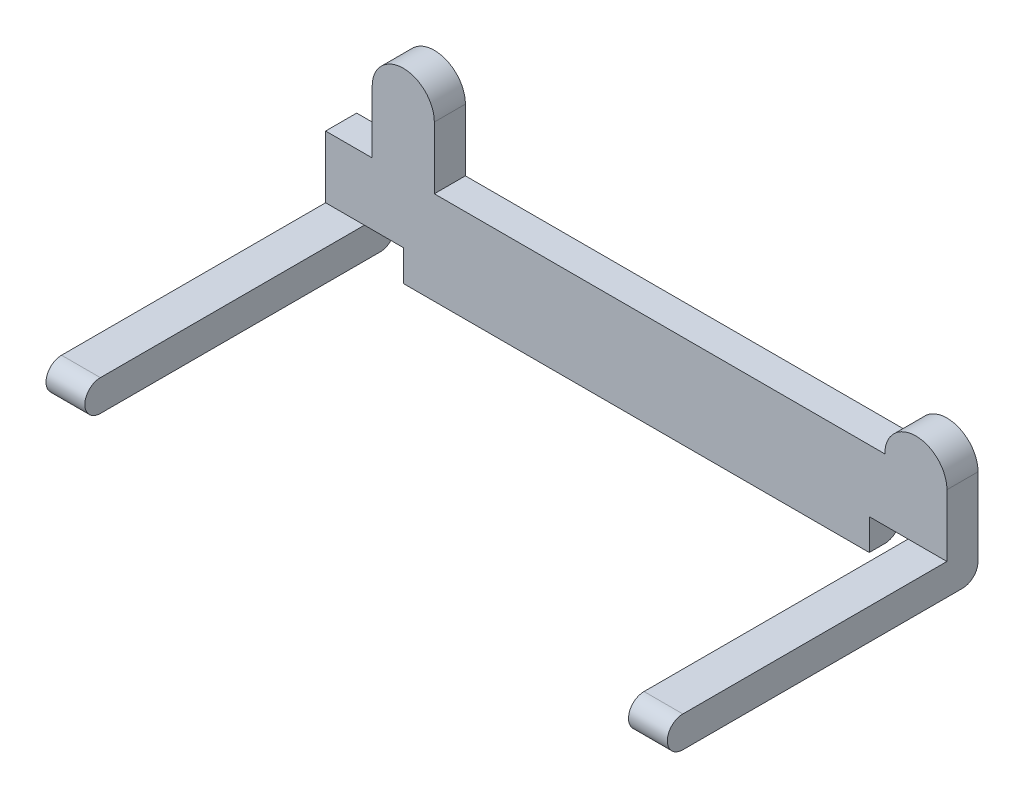
ISO-10303-21;
HEADER;
FILE_DESCRIPTION(('STEP AP214'),'2;1');
FILE_NAME('part.step','',(''),(''),'','','');
FILE_SCHEMA(('AUTOMOTIVE_DESIGN { 1 0 10303 214 1 1 1 1 }'));
ENDSEC;
DATA;
#1=APPLICATION_CONTEXT('core data for automotive mechanical design processes');
#2=APPLICATION_PROTOCOL_DEFINITION('international standard','automotive_design',2000,#1);
#3=PRODUCT_CONTEXT('',#1,'mechanical');
#4=PRODUCT('Part','Part','',(#3));
#5=PRODUCT_RELATED_PRODUCT_CATEGORY('part','',(#4));
#6=PRODUCT_DEFINITION_FORMATION('','',#4);
#7=PRODUCT_DEFINITION_CONTEXT('part definition',#1,'design');
#8=PRODUCT_DEFINITION('design','',#6,#7);
#9=PRODUCT_DEFINITION_SHAPE('','',#8);
#10=(LENGTH_UNIT() NAMED_UNIT(*) SI_UNIT(.MILLI.,.METRE.));
#11=(NAMED_UNIT(*) PLANE_ANGLE_UNIT() SI_UNIT($,.RADIAN.));
#12=(NAMED_UNIT(*) SI_UNIT($,.STERADIAN.) SOLID_ANGLE_UNIT());
#13=UNCERTAINTY_MEASURE_WITH_UNIT(LENGTH_MEASURE(1.E-05),#10,'distance_accuracy_value','');
#14=(GEOMETRIC_REPRESENTATION_CONTEXT(3) GLOBAL_UNCERTAINTY_ASSIGNED_CONTEXT((#13)) GLOBAL_UNIT_ASSIGNED_CONTEXT((#10,
#11,#12)) REPRESENTATION_CONTEXT('',''));
#15=CARTESIAN_POINT('',(0.,0.,0.));
#16=DIRECTION('',(0.,0.,1.));
#17=DIRECTION('',(1.,0.,0.));
#18=AXIS2_PLACEMENT_3D('',#15,#16,#17);
#19=CARTESIAN_POINT('',(80.,-2.,18.));
#20=DIRECTION('',(0.,1.,0.));
#21=DIRECTION('',(0.,0.,1.));
#22=AXIS2_PLACEMENT_3D('',#19,#20,#21);
#23=PLANE('',#22);
#24=DIRECTION('',(-1.,0.,0.));
#25=VECTOR('',#24,1.);
#26=CARTESIAN_POINT('',(80.,-1.99999999999999,-18.));
#27=LINE('',#26,#25);
#28=CARTESIAN_POINT('',(5.,-1.99999999999999,-18.));
#29=VERTEX_POINT('',#28);
#30=CARTESIAN_POINT('',(0.,-1.99999999999999,-18.));
#31=VERTEX_POINT('',#30);
#32=EDGE_CURVE('E316',#29,#31,#27,.T.);
#33=ORIENTED_EDGE('',*,*,#32,.F.);
#34=DIRECTION('',(0.,0.,1.));
#35=VECTOR('',#34,1.);
#36=CARTESIAN_POINT('',(4.99999999999999,-2.,18.));
#37=LINE('',#36,#35);
#38=CARTESIAN_POINT('',(4.99999999999999,-2.,18.));
#39=VERTEX_POINT('',#38);
#40=EDGE_CURVE('E219',#29,#39,#37,.T.);
#41=ORIENTED_EDGE('',*,*,#40,.T.);
#42=DIRECTION('',(-1.,0.,0.));
#43=VECTOR('',#42,1.);
#44=CARTESIAN_POINT('',(80.,-2.,18.));
#45=LINE('',#44,#43);
#46=CARTESIAN_POINT('',(0.,-2.,18.));
#47=VERTEX_POINT('',#46);
#48=EDGE_CURVE('E46',#39,#47,#45,.T.);
#49=ORIENTED_EDGE('',*,*,#48,.T.);
#50=DIRECTION('',(0.,0.,-1.));
#51=VECTOR('',#50,1.);
#52=CARTESIAN_POINT('',(0.,-2.,18.));
#53=LINE('',#52,#51);
#54=EDGE_CURVE('E300',#47,#31,#53,.T.);
#55=ORIENTED_EDGE('',*,*,#54,.T.);
#56=EDGE_LOOP('',(#33,#41,#49,#55));
#57=FACE_BOUND('',#56,.T.);
#58=ADVANCED_FACE('F38',(#57),#23,.F.);
#59=DIRECTION('',(0.,0.,-1.));
#60=VECTOR('',#59,1.);
#61=CARTESIAN_POINT('',(75.,-2.,18.));
#62=LINE('',#61,#60);
#63=CARTESIAN_POINT('',(75.,-2.,18.));
#64=VERTEX_POINT('',#63);
#65=CARTESIAN_POINT('',(75.,-2.,-18.));
#66=VERTEX_POINT('',#65);
#67=EDGE_CURVE('E226',#64,#66,#62,.T.);
#68=ORIENTED_EDGE('',*,*,#67,.T.);
#69=CARTESIAN_POINT('',(80.,-1.99999999999999,-18.));
#70=VERTEX_POINT('',#69);
#71=EDGE_CURVE('E318',#70,#66,#27,.T.);
#72=ORIENTED_EDGE('',*,*,#71,.F.);
#73=DIRECTION('',(0.,0.,-1.));
#74=VECTOR('',#73,1.);
#75=CARTESIAN_POINT('',(80.,-2.,18.));
#76=LINE('',#75,#74);
#77=CARTESIAN_POINT('',(80.,-2.,18.));
#78=VERTEX_POINT('',#77);
#79=EDGE_CURVE('E288',#78,#70,#76,.T.);
#80=ORIENTED_EDGE('',*,*,#79,.F.);
#81=EDGE_CURVE('E11',#78,#64,#45,.T.);
#82=ORIENTED_EDGE('',*,*,#81,.T.);
#83=EDGE_LOOP('',(#68,#72,#80,#82));
#84=FACE_BOUND('',#83,.T.);
#85=ADVANCED_FACE('F399',(#84),#23,.F.);
#86=CARTESIAN_POINT('',(80.,0.,-18.));
#87=DIRECTION('',(-1.,0.,0.));
#88=DIRECTION('',(0.,0.,1.));
#89=AXIS2_PLACEMENT_3D('',#86,#87,#88);
#90=CYLINDRICAL_SURFACE('',#89,2.);
#91=DIRECTION('',(-1.,0.,0.));
#92=VECTOR('',#91,1.);
#93=CARTESIAN_POINT('',(80.,0.,-20.));
#94=LINE('',#93,#92);
#95=CARTESIAN_POINT('',(4.99999999999999,0.,-20.));
#96=VERTEX_POINT('',#95);
#97=CARTESIAN_POINT('',(0.,0.,-20.));
#98=VERTEX_POINT('',#97);
#99=EDGE_CURVE('E313',#96,#98,#94,.T.);
#100=ORIENTED_EDGE('',*,*,#99,.F.);
#101=CARTESIAN_POINT('',(4.99999999999999,0.,-18.));
#102=DIRECTION('',(-1.,0.,0.));
#103=DIRECTION('',(0.,0.,1.));
#104=AXIS2_PLACEMENT_3D('',#101,#102,#103);
#105=CIRCLE('',#104,2.);
#106=EDGE_CURVE('E332',#96,#29,#105,.T.);
#107=ORIENTED_EDGE('',*,*,#106,.T.);
#108=ORIENTED_EDGE('',*,*,#32,.T.);
#109=CARTESIAN_POINT('',(0.,0.,-18.));
#110=DIRECTION('',(1.,0.,0.));
#111=DIRECTION('',(0.,0.,-1.));
#112=AXIS2_PLACEMENT_3D('',#109,#110,#111);
#113=CIRCLE('',#112,2.);
#114=EDGE_CURVE('E303',#31,#98,#113,.T.);
#115=ORIENTED_EDGE('',*,*,#114,.T.);
#116=EDGE_LOOP('',(#100,#107,#108,#115));
#117=FACE_BOUND('',#116,.T.);
#118=ADVANCED_FACE('F329',(#117),#90,.T.);
#119=ORIENTED_EDGE('',*,*,#71,.T.);
#120=CARTESIAN_POINT('',(75.,0.,-18.));
#121=DIRECTION('',(1.,0.,0.));
#122=DIRECTION('',(0.,0.,-1.));
#123=AXIS2_PLACEMENT_3D('',#120,#121,#122);
#124=CIRCLE('',#123,2.);
#125=CARTESIAN_POINT('',(75.,0.,-20.));
#126=VERTEX_POINT('',#125);
#127=EDGE_CURVE('E378',#66,#126,#124,.T.);
#128=ORIENTED_EDGE('',*,*,#127,.T.);
#129=CARTESIAN_POINT('',(80.,0.,-20.));
#130=VERTEX_POINT('',#129);
#131=EDGE_CURVE('E314',#130,#126,#94,.T.);
#132=ORIENTED_EDGE('',*,*,#131,.F.);
#133=CARTESIAN_POINT('',(80.,0.,-18.));
#134=DIRECTION('',(1.,0.,0.));
#135=DIRECTION('',(0.,0.,-1.));
#136=AXIS2_PLACEMENT_3D('',#133,#134,#135);
#137=CIRCLE('',#136,2.);
#138=EDGE_CURVE('E291',#70,#130,#137,.T.);
#139=ORIENTED_EDGE('',*,*,#138,.F.);
#140=EDGE_LOOP('',(#119,#128,#132,#139));
#141=FACE_BOUND('',#140,.T.);
#142=ADVANCED_FACE('F376',(#141),#90,.T.);
#143=CARTESIAN_POINT('',(80.,0.,18.));
#144=DIRECTION('',(-1.,0.,0.));
#145=DIRECTION('',(0.,0.,1.));
#146=AXIS2_PLACEMENT_3D('',#143,#144,#145);
#147=CYLINDRICAL_SURFACE('',#146,2.);
#148=ORIENTED_EDGE('',*,*,#48,.F.);
#149=CARTESIAN_POINT('',(4.99999999999999,0.,18.));
#150=DIRECTION('',(-1.,0.,0.));
#151=DIRECTION('',(0.,0.,1.));
#152=AXIS2_PLACEMENT_3D('',#149,#150,#151);
#153=CIRCLE('',#152,2.);
#154=CARTESIAN_POINT('',(5.,2.,18.));
#155=VERTEX_POINT('',#154);
#156=EDGE_CURVE('E223',#39,#155,#153,.T.);
#157=ORIENTED_EDGE('',*,*,#156,.T.);
#158=DIRECTION('',(-1.,0.,0.));
#159=VECTOR('',#158,1.);
#160=CARTESIAN_POINT('',(80.,2.,18.));
#161=LINE('',#160,#159);
#162=CARTESIAN_POINT('',(0.,2.,18.));
#163=VERTEX_POINT('',#162);
#164=EDGE_CURVE('E297',#155,#163,#161,.T.);
#165=ORIENTED_EDGE('',*,*,#164,.T.);
#166=CARTESIAN_POINT('',(0.,0.,18.));
#167=DIRECTION('',(1.,0.,0.));
#168=DIRECTION('',(0.,0.,-1.));
#169=AXIS2_PLACEMENT_3D('',#166,#167,#168);
#170=CIRCLE('',#169,2.);
#171=EDGE_CURVE('E277',#163,#47,#170,.T.);
#172=ORIENTED_EDGE('',*,*,#171,.T.);
#173=EDGE_LOOP('',(#148,#157,#165,#172));
#174=FACE_BOUND('',#173,.T.);
#175=ADVANCED_FACE('F450',(#174),#147,.T.);
#176=CARTESIAN_POINT('',(80.,2.,18.));
#177=DIRECTION('',(0.,-1.,0.));
#178=DIRECTION('',(0.,0.,-1.));
#179=AXIS2_PLACEMENT_3D('',#176,#177,#178);
#180=PLANE('',#179);
#181=ORIENTED_EDGE('',*,*,#164,.F.);
#182=DIRECTION('',(0.,0.,1.));
#183=VECTOR('',#182,1.);
#184=CARTESIAN_POINT('',(5.,2.00000000000001,-16.));
#185=LINE('',#184,#183);
#186=CARTESIAN_POINT('',(5.,2.00000000000001,-16.));
#187=VERTEX_POINT('',#186);
#188=EDGE_CURVE('E394',#187,#155,#185,.T.);
#189=ORIENTED_EDGE('',*,*,#188,.F.);
#190=DIRECTION('',(1.,0.,0.));
#191=VECTOR('',#190,1.);
#192=CARTESIAN_POINT('',(0.,2.00000000000001,-16.));
#193=LINE('',#192,#191);
#194=CARTESIAN_POINT('',(0.,2.00000000000001,-16.));
#195=VERTEX_POINT('',#194);
#196=EDGE_CURVE('E275',#195,#187,#193,.T.);
#197=ORIENTED_EDGE('',*,*,#196,.F.);
#198=DIRECTION('',(0.,0.,1.));
#199=VECTOR('',#198,1.);
#200=CARTESIAN_POINT('',(0.,2.,18.));
#201=LINE('',#200,#199);
#202=EDGE_CURVE('E289',#195,#163,#201,.T.);
#203=ORIENTED_EDGE('',*,*,#202,.T.);
#204=EDGE_LOOP('',(#181,#189,#197,#203));
#205=FACE_BOUND('',#204,.T.);
#206=ADVANCED_FACE('F448',(#205),#180,.F.);
#207=CARTESIAN_POINT('',(0.,10.,-20.));
#208=DIRECTION('',(0.,1.,0.));
#209=DIRECTION('',(0.,0.,1.));
#210=AXIS2_PLACEMENT_3D('',#207,#208,#209);
#211=PLANE('',#210);
#212=DIRECTION('',(1.,0.,0.));
#213=VECTOR('',#212,1.);
#214=CARTESIAN_POINT('',(0.,10.,-16.));
#215=LINE('',#214,#213);
#216=CARTESIAN_POINT('',(0.,10.,-16.));
#217=VERTEX_POINT('',#216);
#218=CARTESIAN_POINT('',(6.,10.,-16.));
#219=VERTEX_POINT('',#218);
#220=EDGE_CURVE('E278',#217,#219,#215,.T.);
#221=ORIENTED_EDGE('',*,*,#220,.T.);
#222=DIRECTION('',(0.,0.,-1.));
#223=VECTOR('',#222,1.);
#224=CARTESIAN_POINT('',(6.,10.,-16.));
#225=LINE('',#224,#223);
#226=CARTESIAN_POINT('',(6.,10.,-20.));
#227=VERTEX_POINT('',#226);
#228=EDGE_CURVE('E256',#219,#227,#225,.T.);
#229=ORIENTED_EDGE('',*,*,#228,.T.);
#230=DIRECTION('',(1.,0.,0.));
#231=VECTOR('',#230,1.);
#232=CARTESIAN_POINT('',(0.,10.,-20.));
#233=LINE('',#232,#231);
#234=CARTESIAN_POINT('',(0.,10.,-20.));
#235=VERTEX_POINT('',#234);
#236=EDGE_CURVE('E282',#235,#227,#233,.T.);
#237=ORIENTED_EDGE('',*,*,#236,.F.);
#238=DIRECTION('',(0.,0.,1.));
#239=VECTOR('',#238,1.);
#240=CARTESIAN_POINT('',(0.,10.,-20.));
#241=LINE('',#240,#239);
#242=EDGE_CURVE('E264',#235,#217,#241,.T.);
#243=ORIENTED_EDGE('',*,*,#242,.T.);
#244=EDGE_LOOP('',(#221,#229,#237,#243));
#245=FACE_BOUND('',#244,.T.);
#246=ADVANCED_FACE('F347',(#245),#211,.T.);
#247=CARTESIAN_POINT('',(80.,2.,18.));
#248=VERTEX_POINT('',#247);
#249=CARTESIAN_POINT('',(75.,2.,18.));
#250=VERTEX_POINT('',#249);
#251=EDGE_CURVE('E310',#248,#250,#161,.T.);
#252=ORIENTED_EDGE('',*,*,#251,.T.);
#253=CARTESIAN_POINT('',(75.,0.,18.));
#254=DIRECTION('',(1.,0.,0.));
#255=DIRECTION('',(0.,0.,-1.));
#256=AXIS2_PLACEMENT_3D('',#253,#254,#255);
#257=CIRCLE('',#256,2.);
#258=EDGE_CURVE('E220',#250,#64,#257,.T.);
#259=ORIENTED_EDGE('',*,*,#258,.T.);
#260=ORIENTED_EDGE('',*,*,#81,.F.);
#261=CARTESIAN_POINT('',(80.,0.,18.));
#262=DIRECTION('',(1.,0.,0.));
#263=DIRECTION('',(0.,0.,-1.));
#264=AXIS2_PLACEMENT_3D('',#261,#262,#263);
#265=CIRCLE('',#264,2.);
#266=EDGE_CURVE('E285',#248,#78,#265,.T.);
#267=ORIENTED_EDGE('',*,*,#266,.F.);
#268=EDGE_LOOP('',(#252,#259,#260,#267));
#269=FACE_BOUND('',#268,.T.);
#270=ADVANCED_FACE('F40',(#269),#147,.T.);
#271=DIRECTION('',(-1.,0.,0.));
#272=VECTOR('',#271,1.);
#273=CARTESIAN_POINT('',(80.,-1.99999999999999,-16.));
#274=LINE('',#273,#272);
#275=CARTESIAN_POINT('',(70.,-2.,-16.));
#276=VERTEX_POINT('',#275);
#277=CARTESIAN_POINT('',(9.99999999999999,-2.,-16.));
#278=VERTEX_POINT('',#277);
#279=EDGE_CURVE('E213',#276,#278,#274,.T.);
#280=ORIENTED_EDGE('',*,*,#279,.T.);
#281=DIRECTION('',(0.,0.,1.));
#282=VECTOR('',#281,1.);
#283=CARTESIAN_POINT('',(9.99999999999999,-2.,-26.));
#284=LINE('',#283,#282);
#285=CARTESIAN_POINT('',(9.99999999999999,-2.,-18.));
#286=VERTEX_POINT('',#285);
#287=EDGE_CURVE('E195',#286,#278,#284,.T.);
#288=ORIENTED_EDGE('',*,*,#287,.F.);
#289=CARTESIAN_POINT('',(70.,-2.,-18.));
#290=VERTEX_POINT('',#289);
#291=EDGE_CURVE('E320',#290,#286,#27,.T.);
#292=ORIENTED_EDGE('',*,*,#291,.F.);
#293=DIRECTION('',(0.,0.,1.));
#294=VECTOR('',#293,1.);
#295=CARTESIAN_POINT('',(70.,-2.,-26.));
#296=LINE('',#295,#294);
#297=EDGE_CURVE('E215',#290,#276,#296,.T.);
#298=ORIENTED_EDGE('',*,*,#297,.T.);
#299=EDGE_LOOP('',(#280,#288,#292,#298));
#300=FACE_BOUND('',#299,.T.);
#301=ADVANCED_FACE('F218',(#300),#23,.F.);
#302=ORIENTED_EDGE('',*,*,#291,.T.);
#303=CARTESIAN_POINT('',(9.99999999999999,0.,-18.));
#304=DIRECTION('',(1.,0.,0.));
#305=DIRECTION('',(0.,1.,0.));
#306=AXIS2_PLACEMENT_3D('',#303,#304,#305);
#307=CIRCLE('',#306,2.);
#308=CARTESIAN_POINT('',(9.99999999999999,0.,-20.));
#309=VERTEX_POINT('',#308);
#310=EDGE_CURVE('E202',#286,#309,#307,.T.);
#311=ORIENTED_EDGE('',*,*,#310,.T.);
#312=CARTESIAN_POINT('',(70.,0.,-20.));
#313=VERTEX_POINT('',#312);
#314=EDGE_CURVE('E317',#313,#309,#94,.T.);
#315=ORIENTED_EDGE('',*,*,#314,.F.);
#316=CARTESIAN_POINT('',(70.,0.,-18.));
#317=DIRECTION('',(-1.,0.,0.));
#318=DIRECTION('',(0.,0.,1.));
#319=AXIS2_PLACEMENT_3D('',#316,#317,#318);
#320=CIRCLE('',#319,2.);
#321=EDGE_CURVE('E384',#313,#290,#320,.T.);
#322=ORIENTED_EDGE('',*,*,#321,.T.);
#323=EDGE_LOOP('',(#302,#311,#315,#322));
#324=FACE_BOUND('',#323,.T.);
#325=ADVANCED_FACE('F428',(#324),#90,.T.);
#326=CARTESIAN_POINT('',(80.,2.00000000000001,-20.));
#327=DIRECTION('',(0.,0.,1.));
#328=DIRECTION('',(1.,0.,0.));
#329=AXIS2_PLACEMENT_3D('',#326,#327,#328);
#330=PLANE('',#329);
#331=DIRECTION('',(-1.,0.,0.));
#332=VECTOR('',#331,1.);
#333=CARTESIAN_POINT('',(80.,2.00000000000001,-20.));
#334=LINE('',#333,#332);
#335=CARTESIAN_POINT('',(10.,2.00000000000001,-20.));
#336=VERTEX_POINT('',#335);
#337=CARTESIAN_POINT('',(5.,2.00000000000001,-20.));
#338=VERTEX_POINT('',#337);
#339=EDGE_CURVE('E389',#336,#338,#334,.T.);
#340=ORIENTED_EDGE('',*,*,#339,.T.);
#341=DIRECTION('',(0.,-1.,0.));
#342=VECTOR('',#341,1.);
#343=CARTESIAN_POINT('',(4.99999999999999,2.00000000000001,-20.));
#344=LINE('',#343,#342);
#345=EDGE_CURVE('E391',#338,#96,#344,.T.);
#346=ORIENTED_EDGE('',*,*,#345,.T.);
#347=ORIENTED_EDGE('',*,*,#99,.T.);
#348=DIRECTION('',(0.,1.,0.));
#349=VECTOR('',#348,1.);
#350=CARTESIAN_POINT('',(0.,2.00000000000001,-20.));
#351=LINE('',#350,#349);
#352=EDGE_CURVE('E306',#98,#235,#351,.T.);
#353=ORIENTED_EDGE('',*,*,#352,.T.);
#354=ORIENTED_EDGE('',*,*,#236,.T.);
#355=DIRECTION('',(0.,1.,0.));
#356=VECTOR('',#355,1.);
#357=CARTESIAN_POINT('',(6.,10.,-20.));
#358=LINE('',#357,#356);
#359=CARTESIAN_POINT('',(6.,18.,-20.));
#360=VERTEX_POINT('',#359);
#361=EDGE_CURVE('E53',#227,#360,#358,.T.);
#362=ORIENTED_EDGE('',*,*,#361,.T.);
#363=CARTESIAN_POINT('',(10.,18.,-20.));
#364=DIRECTION('',(0.,0.,-1.));
#365=DIRECTION('',(-1.,0.,0.));
#366=AXIS2_PLACEMENT_3D('',#363,#364,#365);
#367=CIRCLE('',#366,4.);
#368=CARTESIAN_POINT('',(14.,18.,-20.));
#369=VERTEX_POINT('',#368);
#370=EDGE_CURVE('E251',#360,#369,#367,.T.);
#371=ORIENTED_EDGE('',*,*,#370,.T.);
#372=DIRECTION('',(0.,-1.,0.));
#373=VECTOR('',#372,1.);
#374=CARTESIAN_POINT('',(14.,10.,-20.));
#375=LINE('',#374,#373);
#376=CARTESIAN_POINT('',(14.,10.,-20.));
#377=VERTEX_POINT('',#376);
#378=EDGE_CURVE('E244',#369,#377,#375,.T.);
#379=ORIENTED_EDGE('',*,*,#378,.T.);
#380=CARTESIAN_POINT('',(72.,10.,-20.));
#381=VERTEX_POINT('',#380);
#382=EDGE_CURVE('E271',#377,#381,#233,.T.);
#383=ORIENTED_EDGE('',*,*,#382,.T.);
#384=CARTESIAN_POINT('',(76.,10.,-20.));
#385=DIRECTION('',(0.,0.,-1.));
#386=DIRECTION('',(-1.,0.,0.));
#387=AXIS2_PLACEMENT_3D('',#384,#385,#386);
#388=CIRCLE('',#387,4.);
#389=CARTESIAN_POINT('',(80.,10.,-20.));
#390=VERTEX_POINT('',#389);
#391=EDGE_CURVE('E232',#381,#390,#388,.T.);
#392=ORIENTED_EDGE('',*,*,#391,.T.);
#393=DIRECTION('',(0.,1.,0.));
#394=VECTOR('',#393,1.);
#395=CARTESIAN_POINT('',(80.,2.00000000000001,-20.));
#396=LINE('',#395,#394);
#397=EDGE_CURVE('E293',#130,#390,#396,.T.);
#398=ORIENTED_EDGE('',*,*,#397,.F.);
#399=ORIENTED_EDGE('',*,*,#131,.T.);
#400=DIRECTION('',(0.,1.,0.));
#401=VECTOR('',#400,1.);
#402=CARTESIAN_POINT('',(75.,2.00000000000001,-20.));
#403=LINE('',#402,#401);
#404=CARTESIAN_POINT('',(75.,2.00000000000001,-20.));
#405=VERTEX_POINT('',#404);
#406=EDGE_CURVE('E375',#126,#405,#403,.T.);
#407=ORIENTED_EDGE('',*,*,#406,.T.);
#408=DIRECTION('',(-1.,0.,0.));
#409=VECTOR('',#408,1.);
#410=CARTESIAN_POINT('',(80.,2.00000000000001,-20.));
#411=LINE('',#410,#409);
#412=CARTESIAN_POINT('',(70.,2.00000000000001,-20.));
#413=VERTEX_POINT('',#412);
#414=EDGE_CURVE('E420',#405,#413,#411,.T.);
#415=ORIENTED_EDGE('',*,*,#414,.T.);
#416=DIRECTION('',(0.,-1.,0.));
#417=VECTOR('',#416,1.);
#418=CARTESIAN_POINT('',(70.,2.00000000000001,-20.));
#419=LINE('',#418,#417);
#420=EDGE_CURVE('E422',#413,#313,#419,.T.);
#421=ORIENTED_EDGE('',*,*,#420,.T.);
#422=ORIENTED_EDGE('',*,*,#314,.T.);
#423=DIRECTION('',(0.,1.,0.));
#424=VECTOR('',#423,1.);
#425=CARTESIAN_POINT('',(9.99999999999999,2.00000000000007,-20.));
#426=LINE('',#425,#424);
#427=EDGE_CURVE('E380',#309,#336,#426,.T.);
#428=ORIENTED_EDGE('',*,*,#427,.T.);
#429=EDGE_LOOP('',(#340,#346,#347,#353,#354,#362,#371,#379,#383,#392,#398,#399,#407,#415,#421,
#422,#428));
#430=FACE_BOUND('',#429,.T.);
#431=ADVANCED_FACE('F344',(#430),#330,.F.);
#432=CARTESIAN_POINT('',(75.,2.00000000000001,-16.));
#433=VERTEX_POINT('',#432);
#434=CARTESIAN_POINT('',(80.,2.00000000000001,-16.));
#435=VERTEX_POINT('',#434);
#436=EDGE_CURVE('E61',#433,#435,#193,.T.);
#437=ORIENTED_EDGE('',*,*,#436,.F.);
#438=DIRECTION('',(0.,0.,-1.));
#439=VECTOR('',#438,1.);
#440=CARTESIAN_POINT('',(75.,2.00000000000001,-16.));
#441=LINE('',#440,#439);
#442=EDGE_CURVE('E396',#250,#433,#441,.T.);
#443=ORIENTED_EDGE('',*,*,#442,.F.);
#444=ORIENTED_EDGE('',*,*,#251,.F.);
#445=DIRECTION('',(0.,0.,1.));
#446=VECTOR('',#445,1.);
#447=CARTESIAN_POINT('',(80.,2.00000000000001,-18.));
#448=LINE('',#447,#446);
#449=EDGE_CURVE('E295',#435,#248,#448,.T.);
#450=ORIENTED_EDGE('',*,*,#449,.F.);
#451=EDGE_LOOP('',(#437,#443,#444,#450));
#452=FACE_BOUND('',#451,.T.);
#453=ADVANCED_FACE('F407',(#452),#180,.F.);
#454=CARTESIAN_POINT('',(80.,0.,18.));
#455=DIRECTION('',(1.,0.,0.));
#456=DIRECTION('',(0.,0.,-1.));
#457=AXIS2_PLACEMENT_3D('',#454,#455,#456);
#458=PLANE('',#457);
#459=ORIENTED_EDGE('',*,*,#397,.T.);
#460=DIRECTION('',(0.,0.,1.));
#461=VECTOR('',#460,1.);
#462=CARTESIAN_POINT('',(80.,10.,-20.));
#463=LINE('',#462,#461);
#464=CARTESIAN_POINT('',(80.,10.,-16.));
#465=VERTEX_POINT('',#464);
#466=EDGE_CURVE('E258',#390,#465,#463,.T.);
#467=ORIENTED_EDGE('',*,*,#466,.T.);
#468=DIRECTION('',(0.,-1.,0.));
#469=VECTOR('',#468,1.);
#470=CARTESIAN_POINT('',(80.,2.00000000000001,-16.));
#471=LINE('',#470,#469);
#472=EDGE_CURVE('E268',#465,#435,#471,.T.);
#473=ORIENTED_EDGE('',*,*,#472,.T.);
#474=ORIENTED_EDGE('',*,*,#449,.T.);
#475=ORIENTED_EDGE('',*,*,#266,.T.);
#476=ORIENTED_EDGE('',*,*,#79,.T.);
#477=ORIENTED_EDGE('',*,*,#138,.T.);
#478=EDGE_LOOP('',(#459,#467,#473,#474,#475,#476,#477));
#479=FACE_BOUND('',#478,.T.);
#480=ADVANCED_FACE('F370',(#479),#458,.T.);
#481=CARTESIAN_POINT('',(0.,0.,18.));
#482=DIRECTION('',(1.,0.,0.));
#483=DIRECTION('',(0.,0.,-1.));
#484=AXIS2_PLACEMENT_3D('',#481,#482,#483);
#485=PLANE('',#484);
#486=ORIENTED_EDGE('',*,*,#171,.F.);
#487=ORIENTED_EDGE('',*,*,#202,.F.);
#488=DIRECTION('',(0.,-1.,0.));
#489=VECTOR('',#488,1.);
#490=CARTESIAN_POINT('',(0.,2.00000000000001,-16.));
#491=LINE('',#490,#489);
#492=EDGE_CURVE('E267',#217,#195,#491,.T.);
#493=ORIENTED_EDGE('',*,*,#492,.F.);
#494=ORIENTED_EDGE('',*,*,#242,.F.);
#495=ORIENTED_EDGE('',*,*,#352,.F.);
#496=ORIENTED_EDGE('',*,*,#114,.F.);
#497=ORIENTED_EDGE('',*,*,#54,.F.);
#498=EDGE_LOOP('',(#486,#487,#493,#494,#495,#496,#497));
#499=FACE_BOUND('',#498,.T.);
#500=ADVANCED_FACE('F338',(#499),#485,.F.);
#501=CARTESIAN_POINT('',(0.,2.00000000000001,-16.));
#502=DIRECTION('',(0.,0.,1.));
#503=DIRECTION('',(1.,0.,0.));
#504=AXIS2_PLACEMENT_3D('',#501,#502,#503);
#505=PLANE('',#504);
#506=DIRECTION('',(-1.,0.,0.));
#507=VECTOR('',#506,1.);
#508=CARTESIAN_POINT('',(5.,2.00000000000001,-16.));
#509=LINE('',#508,#507);
#510=CARTESIAN_POINT('',(10.,2.00000000000001,-16.));
#511=VERTEX_POINT('',#510);
#512=EDGE_CURVE('E208',#511,#187,#509,.T.);
#513=ORIENTED_EDGE('',*,*,#512,.F.);
#514=DIRECTION('',(0.,1.,0.));
#515=VECTOR('',#514,1.);
#516=CARTESIAN_POINT('',(10.,2.00000000000001,-16.));
#517=LINE('',#516,#515);
#518=EDGE_CURVE('E199',#278,#511,#517,.T.);
#519=ORIENTED_EDGE('',*,*,#518,.F.);
#520=ORIENTED_EDGE('',*,*,#279,.F.);
#521=DIRECTION('',(0.,-1.,0.));
#522=VECTOR('',#521,1.);
#523=CARTESIAN_POINT('',(70.,2.00000000000001,-16.));
#524=LINE('',#523,#522);
#525=CARTESIAN_POINT('',(70.,2.00000000000001,-16.));
#526=VERTEX_POINT('',#525);
#527=EDGE_CURVE('E413',#526,#276,#524,.T.);
#528=ORIENTED_EDGE('',*,*,#527,.F.);
#529=DIRECTION('',(-1.,0.,0.));
#530=VECTOR('',#529,1.);
#531=CARTESIAN_POINT('',(75.,2.00000000000001,-16.));
#532=LINE('',#531,#530);
#533=EDGE_CURVE('E416',#433,#526,#532,.T.);
#534=ORIENTED_EDGE('',*,*,#533,.F.);
#535=ORIENTED_EDGE('',*,*,#436,.T.);
#536=ORIENTED_EDGE('',*,*,#472,.F.);
#537=CARTESIAN_POINT('',(76.,10.,-16.));
#538=DIRECTION('',(0.,0.,-1.));
#539=DIRECTION('',(-1.,0.,0.));
#540=AXIS2_PLACEMENT_3D('',#537,#538,#539);
#541=CIRCLE('',#540,4.);
#542=CARTESIAN_POINT('',(72.,10.,-16.));
#543=VERTEX_POINT('',#542);
#544=EDGE_CURVE('E233',#543,#465,#541,.T.);
#545=ORIENTED_EDGE('',*,*,#544,.F.);
#546=CARTESIAN_POINT('',(14.,10.,-16.));
#547=VERTEX_POINT('',#546);
#548=EDGE_CURVE('E281',#547,#543,#215,.T.);
#549=ORIENTED_EDGE('',*,*,#548,.F.);
#550=DIRECTION('',(0.,-1.,0.));
#551=VECTOR('',#550,1.);
#552=CARTESIAN_POINT('',(14.,10.,-16.));
#553=LINE('',#552,#551);
#554=CARTESIAN_POINT('',(14.,18.,-16.));
#555=VERTEX_POINT('',#554);
#556=EDGE_CURVE('E247',#555,#547,#553,.T.);
#557=ORIENTED_EDGE('',*,*,#556,.F.);
#558=CARTESIAN_POINT('',(10.,18.,-16.));
#559=DIRECTION('',(0.,0.,-1.));
#560=DIRECTION('',(-1.,0.,0.));
#561=AXIS2_PLACEMENT_3D('',#558,#559,#560);
#562=CIRCLE('',#561,4.);
#563=CARTESIAN_POINT('',(6.,18.,-16.));
#564=VERTEX_POINT('',#563);
#565=EDGE_CURVE('E243',#564,#555,#562,.T.);
#566=ORIENTED_EDGE('',*,*,#565,.F.);
#567=DIRECTION('',(0.,1.,0.));
#568=VECTOR('',#567,1.);
#569=CARTESIAN_POINT('',(6.,10.,-16.));
#570=LINE('',#569,#568);
#571=EDGE_CURVE('E240',#219,#564,#570,.T.);
#572=ORIENTED_EDGE('',*,*,#571,.F.);
#573=ORIENTED_EDGE('',*,*,#220,.F.);
#574=ORIENTED_EDGE('',*,*,#492,.T.);
#575=ORIENTED_EDGE('',*,*,#196,.T.);
#576=EDGE_LOOP('',(#513,#519,#520,#528,#534,#535,#536,#545,#549,#557,#566,#572,#573,#574,#575));
#577=FACE_BOUND('',#576,.T.);
#578=ADVANCED_FACE('F211',(#577),#505,.T.);
#579=DIRECTION('',(0.,0.,-1.));
#580=VECTOR('',#579,1.);
#581=CARTESIAN_POINT('',(72.,10.,-16.));
#582=LINE('',#581,#580);
#583=EDGE_CURVE('E235',#543,#381,#582,.T.);
#584=ORIENTED_EDGE('',*,*,#583,.T.);
#585=ORIENTED_EDGE('',*,*,#382,.F.);
#586=DIRECTION('',(0.,0.,-1.));
#587=VECTOR('',#586,1.);
#588=CARTESIAN_POINT('',(14.,10.,-16.));
#589=LINE('',#588,#587);
#590=EDGE_CURVE('E259',#547,#377,#589,.T.);
#591=ORIENTED_EDGE('',*,*,#590,.F.);
#592=ORIENTED_EDGE('',*,*,#548,.T.);
#593=EDGE_LOOP('',(#584,#585,#591,#592));
#594=FACE_BOUND('',#593,.T.);
#595=ADVANCED_FACE('F362',(#594),#211,.T.);
#596=CARTESIAN_POINT('',(6.,10.,-16.));
#597=DIRECTION('',(-1.,0.,0.));
#598=DIRECTION('',(0.,-1.,0.));
#599=AXIS2_PLACEMENT_3D('',#596,#597,#598);
#600=PLANE('',#599);
#601=ORIENTED_EDGE('',*,*,#361,.F.);
#602=ORIENTED_EDGE('',*,*,#228,.F.);
#603=ORIENTED_EDGE('',*,*,#571,.T.);
#604=DIRECTION('',(0.,0.,-1.));
#605=VECTOR('',#604,1.);
#606=CARTESIAN_POINT('',(6.,18.,-16.));
#607=LINE('',#606,#605);
#608=EDGE_CURVE('E249',#564,#360,#607,.T.);
#609=ORIENTED_EDGE('',*,*,#608,.T.);
#610=EDGE_LOOP('',(#601,#602,#603,#609));
#611=FACE_BOUND('',#610,.T.);
#612=ADVANCED_FACE('F349',(#611),#600,.T.);
#613=CARTESIAN_POINT('',(14.,10.,-16.));
#614=DIRECTION('',(1.,0.,0.));
#615=DIRECTION('',(0.,1.,0.));
#616=AXIS2_PLACEMENT_3D('',#613,#614,#615);
#617=PLANE('',#616);
#618=ORIENTED_EDGE('',*,*,#378,.F.);
#619=DIRECTION('',(0.,0.,-1.));
#620=VECTOR('',#619,1.);
#621=CARTESIAN_POINT('',(14.,18.,-16.));
#622=LINE('',#621,#620);
#623=EDGE_CURVE('E261',#555,#369,#622,.T.);
#624=ORIENTED_EDGE('',*,*,#623,.F.);
#625=ORIENTED_EDGE('',*,*,#556,.T.);
#626=ORIENTED_EDGE('',*,*,#590,.T.);
#627=EDGE_LOOP('',(#618,#624,#625,#626));
#628=FACE_BOUND('',#627,.T.);
#629=ADVANCED_FACE('F586',(#628),#617,.T.);
#630=CARTESIAN_POINT('',(10.,18.,-16.));
#631=DIRECTION('',(0.,0.,-1.));
#632=DIRECTION('',(-1.,0.,0.));
#633=AXIS2_PLACEMENT_3D('',#630,#631,#632);
#634=CYLINDRICAL_SURFACE('',#633,4.);
#635=ORIENTED_EDGE('',*,*,#370,.F.);
#636=ORIENTED_EDGE('',*,*,#608,.F.);
#637=ORIENTED_EDGE('',*,*,#565,.T.);
#638=ORIENTED_EDGE('',*,*,#623,.T.);
#639=EDGE_LOOP('',(#635,#636,#637,#638));
#640=FACE_BOUND('',#639,.T.);
#641=ADVANCED_FACE('F355',(#640),#634,.T.);
#642=CARTESIAN_POINT('',(76.,10.,-16.));
#643=DIRECTION('',(0.,0.,-1.));
#644=DIRECTION('',(-1.,0.,0.));
#645=AXIS2_PLACEMENT_3D('',#642,#643,#644);
#646=CYLINDRICAL_SURFACE('',#645,4.);
#647=ORIENTED_EDGE('',*,*,#391,.F.);
#648=ORIENTED_EDGE('',*,*,#583,.F.);
#649=ORIENTED_EDGE('',*,*,#544,.T.);
#650=ORIENTED_EDGE('',*,*,#466,.F.);
#651=EDGE_LOOP('',(#647,#648,#649,#650));
#652=FACE_BOUND('',#651,.T.);
#653=ADVANCED_FACE('F366',(#652),#646,.T.);
#654=CARTESIAN_POINT('',(5.,-7.99999999999999,-16.));
#655=DIRECTION('',(-1.,0.,0.));
#656=DIRECTION('',(0.,0.,1.));
#657=AXIS2_PLACEMENT_3D('',#654,#655,#656);
#658=PLANE('',#657);
#659=ORIENTED_EDGE('',*,*,#40,.F.);
#660=ORIENTED_EDGE('',*,*,#106,.F.);
#661=ORIENTED_EDGE('',*,*,#345,.F.);
#662=DIRECTION('',(0.,0.,1.));
#663=VECTOR('',#662,1.);
#664=CARTESIAN_POINT('',(5.,2.00000000000001,-26.));
#665=LINE('',#664,#663);
#666=EDGE_CURVE('E423',#338,#187,#665,.T.);
#667=ORIENTED_EDGE('',*,*,#666,.T.);
#668=ORIENTED_EDGE('',*,*,#188,.T.);
#669=ORIENTED_EDGE('',*,*,#156,.F.);
#670=EDGE_LOOP('',(#659,#660,#661,#667,#668,#669));
#671=FACE_BOUND('',#670,.T.);
#672=ADVANCED_FACE('F444',(#671),#658,.F.);
#673=CARTESIAN_POINT('',(75.,-7.99999999999999,-16.));
#674=DIRECTION('',(1.,0.,0.));
#675=DIRECTION('',(0.,0.,-1.));
#676=AXIS2_PLACEMENT_3D('',#673,#674,#675);
#677=PLANE('',#676);
#678=ORIENTED_EDGE('',*,*,#442,.T.);
#679=DIRECTION('',(0.,0.,1.));
#680=VECTOR('',#679,1.);
#681=CARTESIAN_POINT('',(75.,2.00000000000001,-26.));
#682=LINE('',#681,#680);
#683=EDGE_CURVE('E409',#405,#433,#682,.T.);
#684=ORIENTED_EDGE('',*,*,#683,.F.);
#685=ORIENTED_EDGE('',*,*,#406,.F.);
#686=ORIENTED_EDGE('',*,*,#127,.F.);
#687=ORIENTED_EDGE('',*,*,#67,.F.);
#688=ORIENTED_EDGE('',*,*,#258,.F.);
#689=EDGE_LOOP('',(#678,#684,#685,#686,#687,#688));
#690=FACE_BOUND('',#689,.T.);
#691=ADVANCED_FACE('F401',(#690),#677,.F.);
#692=CARTESIAN_POINT('',(70.,2.00000000000001,-26.));
#693=DIRECTION('',(-1.,0.,0.));
#694=DIRECTION('',(0.,0.,1.));
#695=AXIS2_PLACEMENT_3D('',#692,#693,#694);
#696=PLANE('',#695);
#697=ORIENTED_EDGE('',*,*,#420,.F.);
#698=DIRECTION('',(0.,0.,1.));
#699=VECTOR('',#698,1.);
#700=CARTESIAN_POINT('',(70.,2.00000000000001,-26.));
#701=LINE('',#700,#699);
#702=EDGE_CURVE('E412',#413,#526,#701,.T.);
#703=ORIENTED_EDGE('',*,*,#702,.T.);
#704=ORIENTED_EDGE('',*,*,#527,.T.);
#705=ORIENTED_EDGE('',*,*,#297,.F.);
#706=ORIENTED_EDGE('',*,*,#321,.F.);
#707=EDGE_LOOP('',(#697,#703,#704,#705,#706));
#708=FACE_BOUND('',#707,.T.);
#709=ADVANCED_FACE('F431',(#708),#696,.F.);
#710=CARTESIAN_POINT('',(75.,2.00000000000001,-26.));
#711=DIRECTION('',(0.,1.,0.));
#712=DIRECTION('',(-1.,0.,0.));
#713=AXIS2_PLACEMENT_3D('',#710,#711,#712);
#714=PLANE('',#713);
#715=ORIENTED_EDGE('',*,*,#683,.T.);
#716=ORIENTED_EDGE('',*,*,#533,.T.);
#717=ORIENTED_EDGE('',*,*,#702,.F.);
#718=ORIENTED_EDGE('',*,*,#414,.F.);
#719=EDGE_LOOP('',(#715,#716,#717,#718));
#720=FACE_BOUND('',#719,.T.);
#721=ADVANCED_FACE('F433',(#720),#714,.F.);
#722=CARTESIAN_POINT('',(5.,2.00000000000001,-26.));
#723=DIRECTION('',(0.,1.,0.));
#724=DIRECTION('',(0.,0.,1.));
#725=AXIS2_PLACEMENT_3D('',#722,#723,#724);
#726=PLANE('',#725);
#727=DIRECTION('',(0.,0.,1.));
#728=VECTOR('',#727,1.);
#729=CARTESIAN_POINT('',(10.,2.00000000000001,-26.));
#730=LINE('',#729,#728);
#731=EDGE_CURVE('E207',#336,#511,#730,.T.);
#732=ORIENTED_EDGE('',*,*,#731,.T.);
#733=ORIENTED_EDGE('',*,*,#512,.T.);
#734=ORIENTED_EDGE('',*,*,#666,.F.);
#735=ORIENTED_EDGE('',*,*,#339,.F.);
#736=EDGE_LOOP('',(#732,#733,#734,#735));
#737=FACE_BOUND('',#736,.T.);
#738=ADVANCED_FACE('F441',(#737),#726,.F.);
#739=CARTESIAN_POINT('',(10.,2.00000000000001,-26.));
#740=DIRECTION('',(1.,0.,0.));
#741=DIRECTION('',(0.,1.,0.));
#742=AXIS2_PLACEMENT_3D('',#739,#740,#741);
#743=PLANE('',#742);
#744=ORIENTED_EDGE('',*,*,#287,.T.);
#745=ORIENTED_EDGE('',*,*,#518,.T.);
#746=ORIENTED_EDGE('',*,*,#731,.F.);
#747=ORIENTED_EDGE('',*,*,#427,.F.);
#748=ORIENTED_EDGE('',*,*,#310,.F.);
#749=EDGE_LOOP('',(#744,#745,#746,#747,#748));
#750=FACE_BOUND('',#749,.T.);
#751=ADVANCED_FACE('F197',(#750),#743,.F.);
#752=CLOSED_SHELL('',(#58,#85,#118,#142,#175,#206,#246,#270,#301,#325,#431,#453,#480,#500,#578,
#595,#612,#629,#641,#653,#672,#691,#709,#721,#738,#751));
#753=MANIFOLD_SOLID_BREP('B2',#752);
#754=ADVANCED_BREP_SHAPE_REPRESENTATION('',(#18,#753),#14);
#755=SHAPE_DEFINITION_REPRESENTATION(#9,#754);
ENDSEC;
END-ISO-10303-21;
